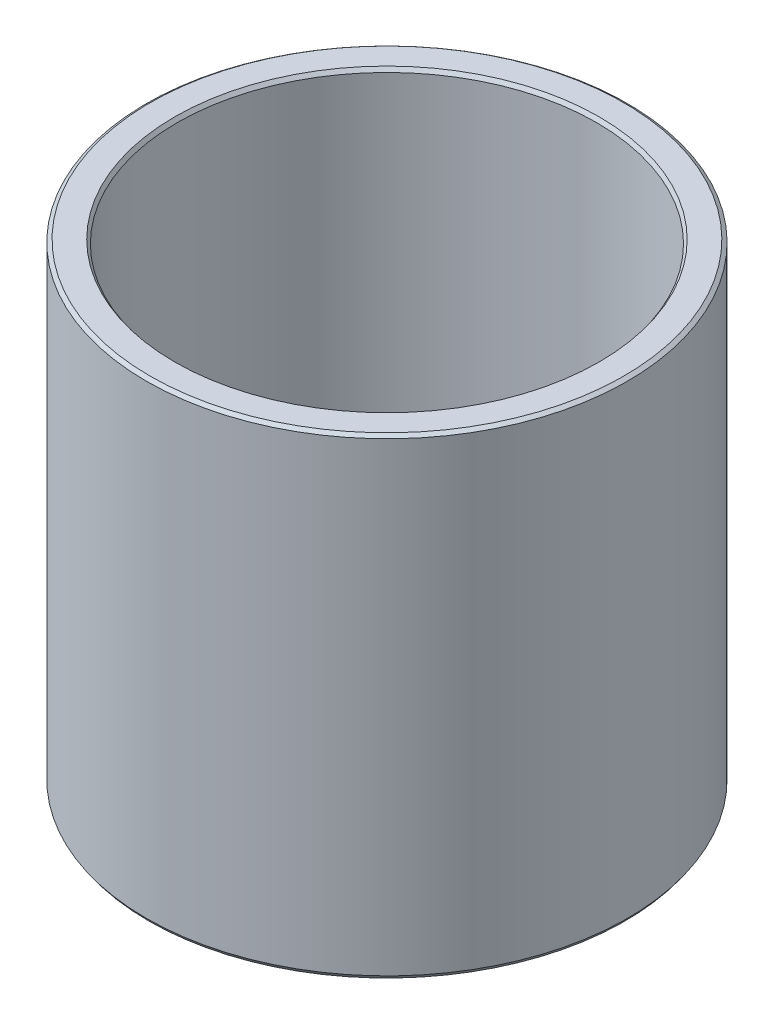
ISO-10303-21;
HEADER;
FILE_DESCRIPTION(('STEP AP214'),'2;1');
FILE_NAME('part.step','',(''),(''),'','','');
FILE_SCHEMA(('AUTOMOTIVE_DESIGN { 1 0 10303 214 1 1 1 1 }'));
ENDSEC;
DATA;
#1=APPLICATION_CONTEXT('core data for automotive mechanical design processes');
#2=APPLICATION_PROTOCOL_DEFINITION('international standard','automotive_design',2000,#1);
#3=PRODUCT_CONTEXT('',#1,'mechanical');
#4=PRODUCT('Part','Part','',(#3));
#5=PRODUCT_RELATED_PRODUCT_CATEGORY('part','',(#4));
#6=PRODUCT_DEFINITION_FORMATION('','',#4);
#7=PRODUCT_DEFINITION_CONTEXT('part definition',#1,'design');
#8=PRODUCT_DEFINITION('design','',#6,#7);
#9=PRODUCT_DEFINITION_SHAPE('','',#8);
#10=(LENGTH_UNIT() NAMED_UNIT(*) SI_UNIT(.MILLI.,.METRE.));
#11=(NAMED_UNIT(*) PLANE_ANGLE_UNIT() SI_UNIT($,.RADIAN.));
#12=(NAMED_UNIT(*) SI_UNIT($,.STERADIAN.) SOLID_ANGLE_UNIT());
#13=UNCERTAINTY_MEASURE_WITH_UNIT(LENGTH_MEASURE(1.E-05),#10,'distance_accuracy_value','');
#14=(GEOMETRIC_REPRESENTATION_CONTEXT(3) GLOBAL_UNCERTAINTY_ASSIGNED_CONTEXT((#13)) GLOBAL_UNIT_ASSIGNED_CONTEXT((#10,
#11,#12)) REPRESENTATION_CONTEXT('',''));
#15=CARTESIAN_POINT('',(0.,0.,0.));
#16=DIRECTION('',(0.,0.,1.));
#17=DIRECTION('',(1.,0.,0.));
#18=AXIS2_PLACEMENT_3D('',#15,#16,#17);
#19=CARTESIAN_POINT('',(0.,107.806731483186,0.));
#20=DIRECTION('',(0.,-1.,0.));
#21=DIRECTION('',(0.,0.,-1.));
#22=AXIS2_PLACEMENT_3D('',#19,#20,#21);
#23=CYLINDRICAL_SURFACE('',#22,55.);
#24=CARTESIAN_POINT('',(0.,0.845900580138559,0.));
#25=DIRECTION('',(0.,1.,0.));
#26=DIRECTION('',(0.,0.,1.));
#27=AXIS2_PLACEMENT_3D('',#24,#25,#26);
#28=CIRCLE('',#27,55.);
#29=CARTESIAN_POINT('',(0.,0.845900580138559,55.));
#30=VERTEX_POINT('',#29);
#31=EDGE_CURVE('E10',#30,#30,#28,.T.);
#32=ORIENTED_EDGE('',*,*,#31,.T.);
#33=EDGE_LOOP('',(#32));
#34=FACE_BOUND('',#33,.T.);
#35=CARTESIAN_POINT('',(0.,107.215766134631,0.));
#36=DIRECTION('',(0.,1.,0.));
#37=DIRECTION('',(0.,0.,1.));
#38=AXIS2_PLACEMENT_3D('',#35,#36,#37);
#39=CIRCLE('',#38,55.);
#40=CARTESIAN_POINT('',(0.,107.215766134631,55.));
#41=VERTEX_POINT('',#40);
#42=EDGE_CURVE('E50',#41,#41,#39,.F.);
#43=ORIENTED_EDGE('',*,*,#42,.T.);
#44=EDGE_LOOP('',(#43));
#45=FACE_BOUND('',#44,.T.);
#46=ADVANCED_FACE('F39',(#34,#45),#23,.T.);
#47=CARTESIAN_POINT('',(0.,107.806731483186,0.));
#48=DIRECTION('',(0.,1.,0.));
#49=DIRECTION('',(0.,0.,1.));
#50=AXIS2_PLACEMENT_3D('',#47,#48,#49);
#51=PLANE('',#50);
#52=CARTESIAN_POINT('',(0.,107.806731483186,0.));
#53=DIRECTION('',(0.,1.,0.));
#54=DIRECTION('',(0.,0.,1.));
#55=AXIS2_PLACEMENT_3D('',#52,#53,#54);
#56=CIRCLE('',#55,48.5451134836684);
#57=CARTESIAN_POINT('',(0.,107.806731483186,48.5451134836684));
#58=VERTEX_POINT('',#57);
#59=EDGE_CURVE('E58',#58,#58,#56,.F.);
#60=ORIENTED_EDGE('',*,*,#59,.T.);
#61=EDGE_LOOP('',(#60));
#62=FACE_BOUND('',#61,.T.);
#63=CARTESIAN_POINT('',(0.,107.806731483186,0.));
#64=DIRECTION('',(0.,1.,0.));
#65=DIRECTION('',(0.,0.,1.));
#66=AXIS2_PLACEMENT_3D('',#63,#64,#65);
#67=CIRCLE('',#66,54.1540994198615);
#68=CARTESIAN_POINT('',(0.,107.806731483186,54.1540994198615));
#69=VERTEX_POINT('',#68);
#70=EDGE_CURVE('E61',#69,#69,#67,.T.);
#71=ORIENTED_EDGE('',*,*,#70,.T.);
#72=EDGE_LOOP('',(#71));
#73=FACE_BOUND('',#72,.T.);
#74=ADVANCED_FACE('F88',(#62,#73),#51,.T.);
#75=CARTESIAN_POINT('',(0.,0.,0.));
#76=DIRECTION('',(0.,1.,0.));
#77=DIRECTION('',(0.,0.,1.));
#78=AXIS2_PLACEMENT_3D('',#75,#76,#77);
#79=PLANE('',#78);
#80=CARTESIAN_POINT('',(0.,0.,0.));
#81=DIRECTION('',(0.,1.,0.));
#82=DIRECTION('',(0.,0.,1.));
#83=AXIS2_PLACEMENT_3D('',#80,#81,#82);
#84=CIRCLE('',#83,48.8000487152523);
#85=CARTESIAN_POINT('',(0.,0.,-48.8000487152523));
#86=VERTEX_POINT('',#85);
#87=EDGE_CURVE('E51',#86,#86,#84,.T.);
#88=ORIENTED_EDGE('',*,*,#87,.T.);
#89=EDGE_LOOP('',(#88));
#90=FACE_BOUND('',#89,.T.);
#91=CARTESIAN_POINT('',(0.,0.,0.));
#92=DIRECTION('',(0.,1.,0.));
#93=DIRECTION('',(0.,0.,1.));
#94=AXIS2_PLACEMENT_3D('',#91,#92,#93);
#95=CIRCLE('',#94,54.4090346514453);
#96=CARTESIAN_POINT('',(0.,0.,54.4090346514453));
#97=VERTEX_POINT('',#96);
#98=EDGE_CURVE('E54',#97,#97,#95,.F.);
#99=ORIENTED_EDGE('',*,*,#98,.T.);
#100=EDGE_LOOP('',(#99));
#101=FACE_BOUND('',#100,.T.);
#102=ADVANCED_FACE('F83',(#90,#101),#79,.F.);
#103=CARTESIAN_POINT('',(0.,107.806731483186,0.));
#104=DIRECTION('',(0.,-1.,0.));
#105=DIRECTION('',(0.,0.,-1.));
#106=AXIS2_PLACEMENT_3D('',#103,#104,#105);
#107=CYLINDRICAL_SURFACE('',#106,47.9541481351138);
#108=CARTESIAN_POINT('',(0.,106.960830903047,0.));
#109=DIRECTION('',(0.,1.,0.));
#110=DIRECTION('',(0.,0.,1.));
#111=AXIS2_PLACEMENT_3D('',#108,#109,#110);
#112=CIRCLE('',#111,47.9541481351138);
#113=CARTESIAN_POINT('',(0.,106.960830903047,47.9541481351138));
#114=VERTEX_POINT('',#113);
#115=EDGE_CURVE('E67',#114,#114,#112,.T.);
#116=ORIENTED_EDGE('',*,*,#115,.T.);
#117=EDGE_LOOP('',(#116));
#118=FACE_BOUND('',#117,.T.);
#119=CARTESIAN_POINT('',(0.,0.590965348554698,0.));
#120=DIRECTION('',(0.,1.,0.));
#121=DIRECTION('',(0.,0.,1.));
#122=AXIS2_PLACEMENT_3D('',#119,#120,#121);
#123=CIRCLE('',#122,47.9541481351138);
#124=CARTESIAN_POINT('',(0.,0.590965348554698,-47.9541481351138));
#125=VERTEX_POINT('',#124);
#126=EDGE_CURVE('E69',#125,#125,#123,.F.);
#127=ORIENTED_EDGE('',*,*,#126,.T.);
#128=EDGE_LOOP('',(#127));
#129=FACE_BOUND('',#128,.T.);
#130=ADVANCED_FACE('F71',(#118,#129),#107,.F.);
#131=CARTESIAN_POINT('',(0.,106.960830903047,0.));
#132=DIRECTION('',(0.,1.,0.));
#133=DIRECTION('',(0.,0.,1.));
#134=AXIS2_PLACEMENT_3D('',#131,#132,#133);
#135=CONICAL_SURFACE('',#134,47.9541481351138,0.609801004791492);
#136=ORIENTED_EDGE('',*,*,#59,.F.);
#137=EDGE_LOOP('',(#136));
#138=FACE_BOUND('',#137,.T.);
#139=ORIENTED_EDGE('',*,*,#115,.F.);
#140=EDGE_LOOP('',(#139));
#141=FACE_BOUND('',#140,.T.);
#142=ADVANCED_FACE('F77',(#138,#141),#135,.F.);
#143=CARTESIAN_POINT('',(0.,0.,0.));
#144=DIRECTION('',(0.,-1.,0.));
#145=DIRECTION('',(0.,0.,-1.));
#146=AXIS2_PLACEMENT_3D('',#143,#144,#145);
#147=CONICAL_SURFACE('',#146,48.8000487152523,0.96099532200337);
#148=CARTESIAN_POINT('',(0.,0.590965348554698,-47.9541481351138));
#149=CARTESIAN_POINT('',(0.,0.584809459507251,-47.9629595994902));
#150=CARTESIAN_POINT('',(0.,0.578653570459807,-47.9717710638667));
#151=CARTESIAN_POINT('',(0.,0.566341792364919,-47.9893939926195));
#152=CARTESIAN_POINT('',(0.,0.560185903317474,-47.998205456996));
#153=CARTESIAN_POINT('',(0.,0.547874125222585,-48.0158283857489));
#154=CARTESIAN_POINT('',(0.,0.54171823617514,-48.0246398501253));
#155=CARTESIAN_POINT('',(0.,0.52940645808025,-48.0422627788782));
#156=CARTESIAN_POINT('',(0.,0.523250569032805,-48.0510742432546));
#157=CARTESIAN_POINT('',(0.,0.510938790937915,-48.0686971720075));
#158=CARTESIAN_POINT('',(0.,0.504782901890471,-48.077508636384));
#159=CARTESIAN_POINT('',(0.,0.492471123795582,-48.0951315651369));
#160=CARTESIAN_POINT('',(0.,0.486315234748137,-48.1039430295133));
#161=CARTESIAN_POINT('',(0.,0.474003456653247,-48.1215659582662));
#162=CARTESIAN_POINT('',(0.,0.467847567605802,-48.1303774226426));
#163=CARTESIAN_POINT('',(0.,0.455535789510913,-48.1480003513955));
#164=CARTESIAN_POINT('',(0.,0.449379900463468,-48.156811815772));
#165=CARTESIAN_POINT('',(0.,0.437068122368579,-48.1744347445249));
#166=CARTESIAN_POINT('',(0.,0.430912233321134,-48.1832462089013));
#167=CARTESIAN_POINT('',(0.,0.418600455226244,-48.2008691376542));
#168=CARTESIAN_POINT('',(0.,0.412444566178799,-48.2096806020306));
#169=CARTESIAN_POINT('',(0.,0.40013278808391,-48.2273035307835));
#170=CARTESIAN_POINT('',(0.,0.393976899036466,-48.23611499516));
#171=CARTESIAN_POINT('',(0.,0.381665120941576,-48.2537379239128));
#172=CARTESIAN_POINT('',(0.,0.375509231894131,-48.2625493882893));
#173=CARTESIAN_POINT('',(0.,0.363197453799241,-48.2801723170422));
#174=CARTESIAN_POINT('',(0.,0.357041564751796,-48.2889837814186));
#175=CARTESIAN_POINT('',(0.,0.344729786656907,-48.3066067101715));
#176=CARTESIAN_POINT('',(0.,0.338573897609463,-48.3154181745479));
#177=CARTESIAN_POINT('',(0.,0.326262119514573,-48.3330411033008));
#178=CARTESIAN_POINT('',(0.,0.320106230467128,-48.3418525676773));
#179=CARTESIAN_POINT('',(0.,0.307794452372238,-48.3594754964302));
#180=CARTESIAN_POINT('',(0.,0.301638563324793,-48.3682869608066));
#181=CARTESIAN_POINT('',(0.,0.289326785229904,-48.3859098895595));
#182=CARTESIAN_POINT('',(0.,0.28317089618246,-48.3947213539359));
#183=CARTESIAN_POINT('',(0.,0.27085911808757,-48.4123442826888));
#184=CARTESIAN_POINT('',(0.,0.264703229040124,-48.4211557470652));
#185=CARTESIAN_POINT('',(0.,0.252391450945235,-48.4387786758181));
#186=CARTESIAN_POINT('',(0.,0.246235561897791,-48.4475901401946));
#187=CARTESIAN_POINT('',(0.,0.233923783802902,-48.4652130689475));
#188=CARTESIAN_POINT('',(0.,0.227767894755457,-48.4740245333239));
#189=CARTESIAN_POINT('',(0.,0.215456116660566,-48.4916474620768));
#190=CARTESIAN_POINT('',(0.,0.209300227613121,-48.5004589264532));
#191=CARTESIAN_POINT('',(0.,0.196988449518232,-48.5180818552061));
#192=CARTESIAN_POINT('',(0.,0.190832560470788,-48.5268933195826));
#193=CARTESIAN_POINT('',(0.,0.178520782375899,-48.5445162483355));
#194=CARTESIAN_POINT('',(0.,0.172364893328454,-48.5533277127119));
#195=CARTESIAN_POINT('',(0.,0.160053115233564,-48.5709506414648));
#196=CARTESIAN_POINT('',(0.,0.153897226186118,-48.5797621058412));
#197=CARTESIAN_POINT('',(0.,0.141585448091229,-48.5973850345941));
#198=CARTESIAN_POINT('',(0.,0.135429559043785,-48.6061964989706));
#199=CARTESIAN_POINT('',(0.,0.123117780948896,-48.6238194277234));
#200=CARTESIAN_POINT('',(0.,0.116961891901451,-48.6326308920999));
#201=CARTESIAN_POINT('',(0.,0.104650113806561,-48.6502538208528));
#202=CARTESIAN_POINT('',(0.,0.0984942247591156,-48.6590652852292));
#203=CARTESIAN_POINT('',(0.,0.0861824466642264,-48.6766882139821));
#204=CARTESIAN_POINT('',(0.,0.0800265576167823,-48.6854996783585));
#205=CARTESIAN_POINT('',(0.,0.0677147795218932,-48.7031226071114));
#206=CARTESIAN_POINT('',(0.,0.061558890474448,-48.7119340714879));
#207=CARTESIAN_POINT('',(0.,0.0492471123795578,-48.7295570002408));
#208=CARTESIAN_POINT('',(0.,0.0430912233321127,-48.7383684646172));
#209=CARTESIAN_POINT('',(0.,0.0307794452372234,-48.7559913933701));
#210=CARTESIAN_POINT('',(0.,0.0246235561897791,-48.7648028577465));
#211=CARTESIAN_POINT('',(0.,0.0123117780948906,-48.7824257864994));
#212=CARTESIAN_POINT('',(0.,0.00615588904744631,-48.7912372508759));
#213=CARTESIAN_POINT('',(0.,0.,-48.8000487152523));
#214=B_SPLINE_CURVE_WITH_KNOTS('',3,(#148,#149,#150,#151,#152,#153,#154,#155,#156,#157,#158,
#159,#160,#161,#162,#163,#164,#165,#166,#167,#168,#169,#170,#171,#172,#173,#174,#175,#176,#177,
#178,#179,#180,#181,#182,#183,#184,#185,#186,#187,#188,#189,#190,#191,#192,#193,#194,#195,#196,
#197,#198,#199,#200,#201,#202,#203,#204,#205,#206,#207,#208,#209,#210,#211,#212,#213),
.UNSPECIFIED.,.F.,.F.,(4,2,2,2,2,2,2,2,2,2,2,2,2,2,2,2,2,2,2,2,2,2,2,2,2,2,2,2,2,2,2,2,4),(0.,
0.0322464241396754,0.0644928482793564,0.0967392724190318,0.128985696558707,0.161232120698388,
0.193478544838063,0.225724968977739,0.25797139311742,0.290217817257095,0.322464241396771,
0.354710665536452,0.386957089676127,0.419203513815802,0.451449937955483,0.483696362095159,
0.515942786234834,0.548189210374515,0.580435634514191,0.612682058653872,0.644928482793547,
0.677174906933222,0.709421331072904,0.741667755212579,0.773914179352254,0.806160603491935,
0.838407027631611,0.870653451771286,0.902899875910967,0.935146300050642,0.967392724190318,
0.999639148329999,1.03188557246967),.UNSPECIFIED.);
#215=EDGE_CURVE('BSEAM73',#125,#86,#214,.T.);
#216=ORIENTED_EDGE('',*,*,#126,.F.);
#217=ORIENTED_EDGE('',*,*,#87,.F.);
#218=ORIENTED_EDGE('',*,*,#215,.T.);
#219=ORIENTED_EDGE('',*,*,#215,.F.);
#220=EDGE_LOOP('',(#216,#218,#217,#219));
#221=FACE_BOUND('',#220,.T.);
#222=ADVANCED_FACE('F73',(#221),#147,.F.);
#223=CARTESIAN_POINT('',(0.,0.845900580138559,0.));
#224=DIRECTION('',(0.,1.,0.));
#225=DIRECTION('',(0.,0.,1.));
#226=AXIS2_PLACEMENT_3D('',#223,#224,#225);
#227=CONICAL_SURFACE('',#226,55.,0.609801004791507);
#228=ORIENTED_EDGE('',*,*,#98,.F.);
#229=EDGE_LOOP('',(#228));
#230=FACE_BOUND('',#229,.T.);
#231=ORIENTED_EDGE('',*,*,#31,.F.);
#232=EDGE_LOOP('',(#231));
#233=FACE_BOUND('',#232,.T.);
#234=ADVANCED_FACE('F76',(#230,#233),#227,.T.);
#235=CARTESIAN_POINT('',(0.,107.806731483186,0.));
#236=DIRECTION('',(0.,-1.,0.));
#237=DIRECTION('',(0.,0.,-1.));
#238=AXIS2_PLACEMENT_3D('',#235,#236,#237);
#239=CONICAL_SURFACE('',#238,54.1540994198615,0.96099532200341);
#240=ORIENTED_EDGE('',*,*,#42,.F.);
#241=EDGE_LOOP('',(#240));
#242=FACE_BOUND('',#241,.T.);
#243=ORIENTED_EDGE('',*,*,#70,.F.);
#244=EDGE_LOOP('',(#243));
#245=FACE_BOUND('',#244,.T.);
#246=ADVANCED_FACE('F45',(#242,#245),#239,.T.);
#247=CLOSED_SHELL('',(#46,#74,#102,#130,#142,#222,#234,#246));
#248=MANIFOLD_SOLID_BREP('B2',#247);
#249=ADVANCED_BREP_SHAPE_REPRESENTATION('',(#18,#248),#14);
#250=SHAPE_DEFINITION_REPRESENTATION(#9,#249);
ENDSEC;
END-ISO-10303-21;
